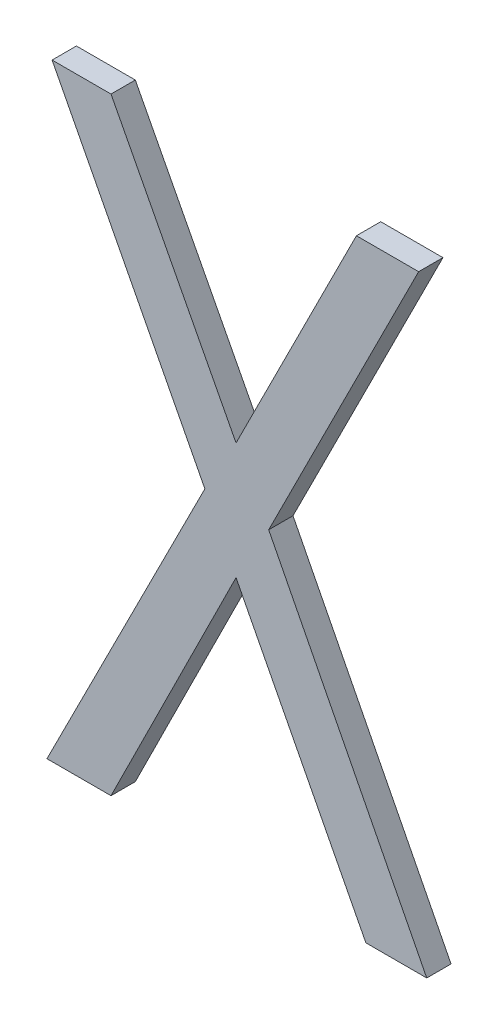
ISO-10303-21;
HEADER;
FILE_DESCRIPTION(('STEP AP214'),'2;1');
FILE_NAME('part.step','',(''),(''),'','','');
FILE_SCHEMA(('AUTOMOTIVE_DESIGN { 1 0 10303 214 1 1 1 1 }'));
ENDSEC;
DATA;
#1=APPLICATION_CONTEXT('core data for automotive mechanical design processes');
#2=APPLICATION_PROTOCOL_DEFINITION('international standard','automotive_design',2000,#1);
#3=PRODUCT_CONTEXT('',#1,'mechanical');
#4=PRODUCT('Part','Part','',(#3));
#5=PRODUCT_RELATED_PRODUCT_CATEGORY('part','',(#4));
#6=PRODUCT_DEFINITION_FORMATION('','',#4);
#7=PRODUCT_DEFINITION_CONTEXT('part definition',#1,'design');
#8=PRODUCT_DEFINITION('design','',#6,#7);
#9=PRODUCT_DEFINITION_SHAPE('','',#8);
#10=(LENGTH_UNIT() NAMED_UNIT(*) SI_UNIT(.MILLI.,.METRE.));
#11=(NAMED_UNIT(*) PLANE_ANGLE_UNIT() SI_UNIT($,.RADIAN.));
#12=(NAMED_UNIT(*) SI_UNIT($,.STERADIAN.) SOLID_ANGLE_UNIT());
#13=UNCERTAINTY_MEASURE_WITH_UNIT(LENGTH_MEASURE(1.E-05),#10,'distance_accuracy_value','');
#14=(GEOMETRIC_REPRESENTATION_CONTEXT(3) GLOBAL_UNCERTAINTY_ASSIGNED_CONTEXT((#13)) GLOBAL_UNIT_ASSIGNED_CONTEXT((#10,
#11,#12)) REPRESENTATION_CONTEXT('',''));
#15=CARTESIAN_POINT('',(0.,0.,0.));
#16=DIRECTION('',(0.,0.,1.));
#17=DIRECTION('',(1.,0.,0.));
#18=AXIS2_PLACEMENT_3D('',#15,#16,#17);
#19=CARTESIAN_POINT('',(160.482663651495,124.913993413852,-39.1));
#20=DIRECTION('',(0.,0.,-1.));
#21=DIRECTION('',(-1.,0.,0.));
#22=AXIS2_PLACEMENT_3D('',#19,#20,#21);
#23=PLANE('',#22);
#24=DIRECTION('',(0.448875504716677,0.893594304628979,0.));
#25=VECTOR('',#24,1.);
#26=CARTESIAN_POINT('',(159.957610010198,126.18583036462,-39.1));
#27=LINE('',#26,#25);
#28=CARTESIAN_POINT('',(159.957610010198,126.18583036462,-39.1));
#29=VERTEX_POINT('',#28);
#30=CARTESIAN_POINT('',(160.574548038722,127.413993413853,-39.1));
#31=VERTEX_POINT('',#30);
#32=EDGE_CURVE('E155',#29,#31,#27,.T.);
#33=ORIENTED_EDGE('',*,*,#32,.F.);
#34=DIRECTION('',(-0.455226922587405,0.890375453924692,0.));
#35=VECTOR('',#34,1.);
#36=CARTESIAN_POINT('',(160.607868750574,124.913993413852,-39.1));
#37=LINE('',#36,#35);
#38=CARTESIAN_POINT('',(160.607868750574,124.913993413852,-39.1));
#39=VERTEX_POINT('',#38);
#40=EDGE_CURVE('E159',#39,#29,#37,.T.);
#41=ORIENTED_EDGE('',*,*,#40,.F.);
#42=DIRECTION('',(-1.,0.,0.));
#43=VECTOR('',#42,1.);
#44=CARTESIAN_POINT('',(160.482663651495,124.913993413852,-39.1));
#45=LINE('',#44,#43);
#46=CARTESIAN_POINT('',(160.357458552417,124.913993413852,-39.1));
#47=VERTEX_POINT('',#46);
#48=EDGE_CURVE('E20',#39,#47,#45,.T.);
#49=ORIENTED_EDGE('',*,*,#48,.T.);
#50=DIRECTION('',(0.458860330473977,-0.888508411393675,0.));
#51=VECTOR('',#50,1.);
#52=CARTESIAN_POINT('',(159.823317444251,125.9482708093,-39.1));
#53=LINE('',#52,#51);
#54=CARTESIAN_POINT('',(159.823317444251,125.9482708093,-39.1));
#55=VERTEX_POINT('',#54);
#56=EDGE_CURVE('E116',#55,#47,#53,.T.);
#57=ORIENTED_EDGE('',*,*,#56,.F.);
#58=DIRECTION('',(0.445351686650897,0.895355725506461,0.));
#59=VECTOR('',#58,1.);
#60=CARTESIAN_POINT('',(159.308865847633,124.913993413852,-39.1));
#61=LINE('',#60,#59);
#62=CARTESIAN_POINT('',(159.308865847633,124.913993413852,-39.1));
#63=VERTEX_POINT('',#62);
#64=EDGE_CURVE('E107',#63,#55,#61,.T.);
#65=ORIENTED_EDGE('',*,*,#64,.F.);
#66=DIRECTION('',(1.,0.,0.));
#67=VECTOR('',#66,1.);
#68=CARTESIAN_POINT('',(159.045329308444,124.913993413852,-39.1));
#69=LINE('',#68,#67);
#70=CARTESIAN_POINT('',(159.045329308444,124.913993413852,-39.1));
#71=VERTEX_POINT('',#70);
#72=EDGE_CURVE('E102',#71,#63,#69,.T.);
#73=ORIENTED_EDGE('',*,*,#72,.F.);
#74=DIRECTION('',(-0.450849374392849,-0.892600045714528,0.));
#75=VECTOR('',#74,1.);
#76=CARTESIAN_POINT('',(159.695083189549,126.200388331799,-39.1));
#77=LINE('',#76,#75);
#78=CARTESIAN_POINT('',(159.695083189549,126.200388331798,-39.1));
#79=VERTEX_POINT('',#78);
#80=EDGE_CURVE('E131',#79,#71,#77,.T.);
#81=ORIENTED_EDGE('',*,*,#80,.F.);
#82=DIRECTION('',(0.459897940742603,-0.88797178113987,0.));
#83=VECTOR('',#82,1.);
#84=CARTESIAN_POINT('',(159.066533397804,127.413993413853,-39.1));
#85=LINE('',#84,#83);
#86=CARTESIAN_POINT('',(159.066533397804,127.413993413853,-39.1));
#87=VERTEX_POINT('',#86);
#88=EDGE_CURVE('E135',#87,#79,#85,.T.);
#89=ORIENTED_EDGE('',*,*,#88,.F.);
#90=DIRECTION('',(1.,0.,0.));
#91=VECTOR('',#90,1.);
#92=CARTESIAN_POINT('',(159.308865847633,127.413993413853,-39.1));
#93=LINE('',#92,#91);
#94=CARTESIAN_POINT('',(159.308865847633,127.413993413853,-39.1));
#95=VERTEX_POINT('',#94);
#96=EDGE_CURVE('E139',#95,#87,#93,.F.);
#97=ORIENTED_EDGE('',*,*,#96,.F.);
#98=DIRECTION('',(-0.462588432121608,0.886573145582062,0.));
#99=VECTOR('',#98,1.);
#100=CARTESIAN_POINT('',(159.823317444251,126.428022000406,-39.1));
#101=LINE('',#100,#99);
#102=CARTESIAN_POINT('',(159.823317444251,126.428022000406,-39.1));
#103=VERTEX_POINT('',#102);
#104=EDGE_CURVE('E143',#103,#95,#101,.T.);
#105=ORIENTED_EDGE('',*,*,#104,.F.);
#106=DIRECTION('',(-0.448866842978253,-0.893598655591388,0.));
#107=VECTOR('',#106,1.);
#108=CARTESIAN_POINT('',(160.31858438859,127.413993413853,-39.1));
#109=LINE('',#108,#107);
#110=CARTESIAN_POINT('',(160.31858438859,127.413993413853,-39.1));
#111=VERTEX_POINT('',#110);
#112=EDGE_CURVE('E147',#111,#103,#109,.T.);
#113=ORIENTED_EDGE('',*,*,#112,.F.);
#114=DIRECTION('',(1.,0.,0.));
#115=VECTOR('',#114,1.);
#116=CARTESIAN_POINT('',(160.574548038722,127.413993413853,-39.1));
#117=LINE('',#116,#115);
#118=EDGE_CURVE('E151',#31,#111,#117,.F.);
#119=ORIENTED_EDGE('',*,*,#118,.F.);
#120=EDGE_LOOP('',(#33,#41,#49,#57,#65,#73,#81,#89,#97,#105,#113,#119));
#121=FACE_BOUND('',#120,.T.);
#122=ADVANCED_FACE('F17',(#121),#23,.T.);
#123=CARTESIAN_POINT('',(159.823317444251,125.9482708093,-39.1));
#124=DIRECTION('',(-0.888508411393675,-0.458860330473977,0.));
#125=DIRECTION('',(0.458860330473977,-0.888508411393675,0.));
#126=AXIS2_PLACEMENT_3D('',#123,#124,#125);
#127=PLANE('',#126);
#128=ORIENTED_EDGE('',*,*,#56,.T.);
#129=DIRECTION('',(0.,0.,-1.));
#130=VECTOR('',#129,1.);
#131=CARTESIAN_POINT('',(160.357458552417,124.913993413852,-39.1));
#132=LINE('',#131,#130);
#133=CARTESIAN_POINT('',(160.357458552417,124.913993413852,-39.));
#134=VERTEX_POINT('',#133);
#135=EDGE_CURVE('E163',#134,#47,#132,.T.);
#136=ORIENTED_EDGE('',*,*,#135,.F.);
#137=DIRECTION('',(-0.458860330473984,0.888508411393672,0.));
#138=VECTOR('',#137,1.);
#139=CARTESIAN_POINT('',(160.357458552417,124.913993413852,-39.));
#140=LINE('',#139,#138);
#141=CARTESIAN_POINT('',(159.823317444251,125.9482708093,-39.));
#142=VERTEX_POINT('',#141);
#143=EDGE_CURVE('E126',#134,#142,#140,.T.);
#144=ORIENTED_EDGE('',*,*,#143,.T.);
#145=DIRECTION('',(0.,0.,1.));
#146=VECTOR('',#145,1.);
#147=CARTESIAN_POINT('',(159.823317444251,125.9482708093,-39.1));
#148=LINE('',#147,#146);
#149=EDGE_CURVE('E112',#55,#142,#148,.T.);
#150=ORIENTED_EDGE('',*,*,#149,.F.);
#151=EDGE_LOOP('',(#128,#136,#144,#150));
#152=FACE_BOUND('',#151,.T.);
#153=ADVANCED_FACE('F125',(#152),#127,.T.);
#154=CARTESIAN_POINT('',(159.308865847633,124.913993413852,-39.1));
#155=DIRECTION('',(0.895355725506461,-0.445351686650897,0.));
#156=DIRECTION('',(0.445351686650897,0.895355725506461,0.));
#157=AXIS2_PLACEMENT_3D('',#154,#155,#156);
#158=PLANE('',#157);
#159=ORIENTED_EDGE('',*,*,#64,.T.);
#160=ORIENTED_EDGE('',*,*,#149,.T.);
#161=DIRECTION('',(-0.445351686650952,-0.895355725506434,0.));
#162=VECTOR('',#161,1.);
#163=CARTESIAN_POINT('',(159.823317444251,125.9482708093,-39.));
#164=LINE('',#163,#162);
#165=CARTESIAN_POINT('',(159.308865847633,124.913993413852,-39.));
#166=VERTEX_POINT('',#165);
#167=EDGE_CURVE('E167',#142,#166,#164,.T.);
#168=ORIENTED_EDGE('',*,*,#167,.T.);
#169=DIRECTION('',(0.,0.,-1.));
#170=VECTOR('',#169,1.);
#171=CARTESIAN_POINT('',(159.308865847633,124.913993413852,-39.1));
#172=LINE('',#171,#170);
#173=EDGE_CURVE('E114',#63,#166,#172,.F.);
#174=ORIENTED_EDGE('',*,*,#173,.F.);
#175=EDGE_LOOP('',(#159,#160,#168,#174));
#176=FACE_BOUND('',#175,.T.);
#177=ADVANCED_FACE('F109',(#176),#158,.T.);
#178=CARTESIAN_POINT('',(159.045329308444,124.913993413852,-39.1));
#179=DIRECTION('',(0.,-1.,0.));
#180=DIRECTION('',(0.,0.,-1.));
#181=AXIS2_PLACEMENT_3D('',#178,#179,#180);
#182=PLANE('',#181);
#183=ORIENTED_EDGE('',*,*,#72,.T.);
#184=ORIENTED_EDGE('',*,*,#173,.T.);
#185=DIRECTION('',(-1.,0.,0.));
#186=VECTOR('',#185,1.);
#187=CARTESIAN_POINT('',(160.482663651495,124.913993413852,-39.));
#188=LINE('',#187,#186);
#189=CARTESIAN_POINT('',(159.045329308444,124.913993413852,-39.));
#190=VERTEX_POINT('',#189);
#191=EDGE_CURVE('E169',#166,#190,#188,.T.);
#192=ORIENTED_EDGE('',*,*,#191,.T.);
#193=DIRECTION('',(0.,0.,1.));
#194=VECTOR('',#193,1.);
#195=CARTESIAN_POINT('',(159.045329308444,124.913993413852,-39.1));
#196=LINE('',#195,#194);
#197=EDGE_CURVE('E133',#71,#190,#196,.T.);
#198=ORIENTED_EDGE('',*,*,#197,.F.);
#199=EDGE_LOOP('',(#183,#184,#192,#198));
#200=FACE_BOUND('',#199,.T.);
#201=ADVANCED_FACE('F234',(#200),#182,.T.);
#202=CARTESIAN_POINT('',(159.695083189549,126.200388331799,-39.1));
#203=DIRECTION('',(-0.892600045714528,0.450849374392849,0.));
#204=DIRECTION('',(-0.450849374392849,-0.892600045714528,0.));
#205=AXIS2_PLACEMENT_3D('',#202,#203,#204);
#206=PLANE('',#205);
#207=ORIENTED_EDGE('',*,*,#80,.T.);
#208=ORIENTED_EDGE('',*,*,#197,.T.);
#209=DIRECTION('',(0.45084937439287,0.892600045714517,0.));
#210=VECTOR('',#209,1.);
#211=CARTESIAN_POINT('',(159.045329308444,124.913993413852,-39.));
#212=LINE('',#211,#210);
#213=CARTESIAN_POINT('',(159.695083189549,126.200388331798,-39.));
#214=VERTEX_POINT('',#213);
#215=EDGE_CURVE('E172',#190,#214,#212,.T.);
#216=ORIENTED_EDGE('',*,*,#215,.T.);
#217=DIRECTION('',(0.,0.,1.));
#218=VECTOR('',#217,1.);
#219=CARTESIAN_POINT('',(159.695083189549,126.200388331798,-39.1));
#220=LINE('',#219,#218);
#221=EDGE_CURVE('E137',#79,#214,#220,.T.);
#222=ORIENTED_EDGE('',*,*,#221,.F.);
#223=EDGE_LOOP('',(#207,#208,#216,#222));
#224=FACE_BOUND('',#223,.T.);
#225=ADVANCED_FACE('F233',(#224),#206,.T.);
#226=CARTESIAN_POINT('',(159.066533397804,127.413993413853,-39.1));
#227=DIRECTION('',(-0.88797178113987,-0.459897940742603,0.));
#228=DIRECTION('',(0.459897940742603,-0.88797178113987,0.));
#229=AXIS2_PLACEMENT_3D('',#226,#227,#228);
#230=PLANE('',#229);
#231=ORIENTED_EDGE('',*,*,#88,.T.);
#232=ORIENTED_EDGE('',*,*,#221,.T.);
#233=DIRECTION('',(-0.459897940742623,0.887971781139859,0.));
#234=VECTOR('',#233,1.);
#235=CARTESIAN_POINT('',(159.695083189549,126.200388331799,-39.));
#236=LINE('',#235,#234);
#237=CARTESIAN_POINT('',(159.066533397804,127.413993413853,-39.));
#238=VERTEX_POINT('',#237);
#239=EDGE_CURVE('E175',#214,#238,#236,.T.);
#240=ORIENTED_EDGE('',*,*,#239,.T.);
#241=DIRECTION('',(0.,0.,1.));
#242=VECTOR('',#241,1.);
#243=CARTESIAN_POINT('',(159.066533397804,127.413993413853,-39.1));
#244=LINE('',#243,#242);
#245=EDGE_CURVE('E141',#87,#238,#244,.T.);
#246=ORIENTED_EDGE('',*,*,#245,.F.);
#247=EDGE_LOOP('',(#231,#232,#240,#246));
#248=FACE_BOUND('',#247,.T.);
#249=ADVANCED_FACE('F227',(#248),#230,.T.);
#250=CARTESIAN_POINT('',(159.308865847633,127.413993413853,-39.1));
#251=DIRECTION('',(0.,1.,0.));
#252=DIRECTION('',(0.,0.,1.));
#253=AXIS2_PLACEMENT_3D('',#250,#251,#252);
#254=PLANE('',#253);
#255=ORIENTED_EDGE('',*,*,#96,.T.);
#256=ORIENTED_EDGE('',*,*,#245,.T.);
#257=DIRECTION('',(-1.,0.,0.));
#258=VECTOR('',#257,1.);
#259=CARTESIAN_POINT('',(160.482663651495,127.413993413853,-39.));
#260=LINE('',#259,#258);
#261=CARTESIAN_POINT('',(159.308865847633,127.413993413853,-39.));
#262=VERTEX_POINT('',#261);
#263=EDGE_CURVE('E178',#238,#262,#260,.F.);
#264=ORIENTED_EDGE('',*,*,#263,.T.);
#265=DIRECTION('',(0.,0.,1.));
#266=VECTOR('',#265,1.);
#267=CARTESIAN_POINT('',(159.308865847633,127.413993413853,-39.1));
#268=LINE('',#267,#266);
#269=EDGE_CURVE('E145',#95,#262,#268,.T.);
#270=ORIENTED_EDGE('',*,*,#269,.F.);
#271=EDGE_LOOP('',(#255,#256,#264,#270));
#272=FACE_BOUND('',#271,.T.);
#273=ADVANCED_FACE('F223',(#272),#254,.T.);
#274=CARTESIAN_POINT('',(159.823317444251,126.428022000406,-39.1));
#275=DIRECTION('',(0.886573145582062,0.462588432121608,0.));
#276=DIRECTION('',(-0.462588432121608,0.886573145582062,0.));
#277=AXIS2_PLACEMENT_3D('',#274,#275,#276);
#278=PLANE('',#277);
#279=ORIENTED_EDGE('',*,*,#104,.T.);
#280=ORIENTED_EDGE('',*,*,#269,.T.);
#281=DIRECTION('',(0.462588432121642,-0.886573145582045,0.));
#282=VECTOR('',#281,1.);
#283=CARTESIAN_POINT('',(159.308865847633,127.413993413853,-39.));
#284=LINE('',#283,#282);
#285=CARTESIAN_POINT('',(159.823317444251,126.428022000406,-39.));
#286=VERTEX_POINT('',#285);
#287=EDGE_CURVE('E181',#262,#286,#284,.T.);
#288=ORIENTED_EDGE('',*,*,#287,.T.);
#289=DIRECTION('',(0.,0.,1.));
#290=VECTOR('',#289,1.);
#291=CARTESIAN_POINT('',(159.823317444251,126.428022000406,-39.1));
#292=LINE('',#291,#290);
#293=EDGE_CURVE('E149',#103,#286,#292,.T.);
#294=ORIENTED_EDGE('',*,*,#293,.F.);
#295=EDGE_LOOP('',(#279,#280,#288,#294));
#296=FACE_BOUND('',#295,.T.);
#297=ADVANCED_FACE('F217',(#296),#278,.T.);
#298=CARTESIAN_POINT('',(160.31858438859,127.413993413853,-39.1));
#299=DIRECTION('',(-0.893598655591388,0.448866842978253,0.));
#300=DIRECTION('',(-0.448866842978253,-0.893598655591388,0.));
#301=AXIS2_PLACEMENT_3D('',#298,#299,#300);
#302=PLANE('',#301);
#303=ORIENTED_EDGE('',*,*,#112,.T.);
#304=ORIENTED_EDGE('',*,*,#293,.T.);
#305=DIRECTION('',(0.448866842978172,0.893598655591429,0.));
#306=VECTOR('',#305,1.);
#307=CARTESIAN_POINT('',(159.823317444251,126.428022000406,-39.));
#308=LINE('',#307,#306);
#309=CARTESIAN_POINT('',(160.31858438859,127.413993413853,-39.));
#310=VERTEX_POINT('',#309);
#311=EDGE_CURVE('E184',#286,#310,#308,.T.);
#312=ORIENTED_EDGE('',*,*,#311,.T.);
#313=DIRECTION('',(0.,0.,1.));
#314=VECTOR('',#313,1.);
#315=CARTESIAN_POINT('',(160.31858438859,127.413993413853,-39.1));
#316=LINE('',#315,#314);
#317=EDGE_CURVE('E153',#111,#310,#316,.T.);
#318=ORIENTED_EDGE('',*,*,#317,.F.);
#319=EDGE_LOOP('',(#303,#304,#312,#318));
#320=FACE_BOUND('',#319,.T.);
#321=ADVANCED_FACE('F213',(#320),#302,.T.);
#322=CARTESIAN_POINT('',(160.574548038722,127.413993413853,-39.1));
#323=DIRECTION('',(0.,1.,0.));
#324=DIRECTION('',(0.,0.,1.));
#325=AXIS2_PLACEMENT_3D('',#322,#323,#324);
#326=PLANE('',#325);
#327=ORIENTED_EDGE('',*,*,#118,.T.);
#328=ORIENTED_EDGE('',*,*,#317,.T.);
#329=DIRECTION('',(-1.,0.,0.));
#330=VECTOR('',#329,1.);
#331=CARTESIAN_POINT('',(160.482663651495,127.413993413853,-39.));
#332=LINE('',#331,#330);
#333=CARTESIAN_POINT('',(160.574548038722,127.413993413853,-39.));
#334=VERTEX_POINT('',#333);
#335=EDGE_CURVE('E187',#310,#334,#332,.F.);
#336=ORIENTED_EDGE('',*,*,#335,.T.);
#337=DIRECTION('',(0.,0.,1.));
#338=VECTOR('',#337,1.);
#339=CARTESIAN_POINT('',(160.574548038722,127.413993413853,-39.1));
#340=LINE('',#339,#338);
#341=EDGE_CURVE('E157',#31,#334,#340,.T.);
#342=ORIENTED_EDGE('',*,*,#341,.F.);
#343=EDGE_LOOP('',(#327,#328,#336,#342));
#344=FACE_BOUND('',#343,.T.);
#345=ADVANCED_FACE('F207',(#344),#326,.T.);
#346=CARTESIAN_POINT('',(159.957610010198,126.18583036462,-39.1));
#347=DIRECTION('',(0.893594304628979,-0.448875504716677,0.));
#348=DIRECTION('',(0.448875504716677,0.893594304628979,0.));
#349=AXIS2_PLACEMENT_3D('',#346,#347,#348);
#350=PLANE('',#349);
#351=ORIENTED_EDGE('',*,*,#32,.T.);
#352=ORIENTED_EDGE('',*,*,#341,.T.);
#353=DIRECTION('',(-0.448875504716713,-0.893594304628961,0.));
#354=VECTOR('',#353,1.);
#355=CARTESIAN_POINT('',(160.574548038722,127.413993413853,-39.));
#356=LINE('',#355,#354);
#357=CARTESIAN_POINT('',(159.957610010198,126.18583036462,-39.));
#358=VERTEX_POINT('',#357);
#359=EDGE_CURVE('E190',#334,#358,#356,.T.);
#360=ORIENTED_EDGE('',*,*,#359,.T.);
#361=DIRECTION('',(0.,0.,1.));
#362=VECTOR('',#361,1.);
#363=CARTESIAN_POINT('',(159.957610010198,126.18583036462,-39.1));
#364=LINE('',#363,#362);
#365=EDGE_CURVE('E161',#29,#358,#364,.T.);
#366=ORIENTED_EDGE('',*,*,#365,.F.);
#367=EDGE_LOOP('',(#351,#352,#360,#366));
#368=FACE_BOUND('',#367,.T.);
#369=ADVANCED_FACE('F203',(#368),#350,.T.);
#370=CARTESIAN_POINT('',(160.607868750574,124.913993413852,-39.1));
#371=DIRECTION('',(0.890375453924692,0.455226922587405,0.));
#372=DIRECTION('',(-0.455226922587405,0.890375453924692,0.));
#373=AXIS2_PLACEMENT_3D('',#370,#371,#372);
#374=PLANE('',#373);
#375=ORIENTED_EDGE('',*,*,#40,.T.);
#376=ORIENTED_EDGE('',*,*,#365,.T.);
#377=DIRECTION('',(0.455226922587396,-0.890375453924696,0.));
#378=VECTOR('',#377,1.);
#379=CARTESIAN_POINT('',(159.957610010198,126.18583036462,-39.));
#380=LINE('',#379,#378);
#381=CARTESIAN_POINT('',(160.607868750574,124.913993413852,-39.));
#382=VERTEX_POINT('',#381);
#383=EDGE_CURVE('E26',#358,#382,#380,.T.);
#384=ORIENTED_EDGE('',*,*,#383,.T.);
#385=DIRECTION('',(0.,0.,-1.));
#386=VECTOR('',#385,1.);
#387=CARTESIAN_POINT('',(160.607868750574,124.913993413852,-39.1));
#388=LINE('',#387,#386);
#389=EDGE_CURVE('E34',#39,#382,#388,.F.);
#390=ORIENTED_EDGE('',*,*,#389,.F.);
#391=EDGE_LOOP('',(#375,#376,#384,#390));
#392=FACE_BOUND('',#391,.T.);
#393=ADVANCED_FACE('F196',(#392),#374,.T.);
#394=CARTESIAN_POINT('',(160.357458552417,124.913993413852,-39.1));
#395=DIRECTION('',(0.,-1.,0.));
#396=DIRECTION('',(0.,0.,-1.));
#397=AXIS2_PLACEMENT_3D('',#394,#395,#396);
#398=PLANE('',#397);
#399=ORIENTED_EDGE('',*,*,#48,.F.);
#400=ORIENTED_EDGE('',*,*,#389,.T.);
#401=DIRECTION('',(-1.,0.,0.));
#402=VECTOR('',#401,1.);
#403=CARTESIAN_POINT('',(160.482663651495,124.913993413852,-39.));
#404=LINE('',#403,#402);
#405=EDGE_CURVE('E11',#382,#134,#404,.T.);
#406=ORIENTED_EDGE('',*,*,#405,.T.);
#407=ORIENTED_EDGE('',*,*,#135,.T.);
#408=EDGE_LOOP('',(#399,#400,#406,#407));
#409=FACE_BOUND('',#408,.T.);
#410=ADVANCED_FACE('F235',(#409),#398,.T.);
#411=CARTESIAN_POINT('',(160.482663651495,124.913993413852,-39.));
#412=DIRECTION('',(0.,0.,-1.));
#413=DIRECTION('',(-1.,0.,0.));
#414=AXIS2_PLACEMENT_3D('',#411,#412,#413);
#415=PLANE('',#414);
#416=ORIENTED_EDGE('',*,*,#383,.F.);
#417=ORIENTED_EDGE('',*,*,#359,.F.);
#418=ORIENTED_EDGE('',*,*,#335,.F.);
#419=ORIENTED_EDGE('',*,*,#311,.F.);
#420=ORIENTED_EDGE('',*,*,#287,.F.);
#421=ORIENTED_EDGE('',*,*,#263,.F.);
#422=ORIENTED_EDGE('',*,*,#239,.F.);
#423=ORIENTED_EDGE('',*,*,#215,.F.);
#424=ORIENTED_EDGE('',*,*,#191,.F.);
#425=ORIENTED_EDGE('',*,*,#167,.F.);
#426=ORIENTED_EDGE('',*,*,#143,.F.);
#427=ORIENTED_EDGE('',*,*,#405,.F.);
#428=EDGE_LOOP('',(#416,#417,#418,#419,#420,#421,#422,#423,#424,#425,#426,#427));
#429=FACE_BOUND('',#428,.T.);
#430=ADVANCED_FACE('F200',(#429),#415,.F.);
#431=CLOSED_SHELL('',(#122,#153,#177,#201,#225,#249,#273,#297,#321,#345,#369,#393,#410,#430));
#432=MANIFOLD_SOLID_BREP('B1',#431);
#433=ADVANCED_BREP_SHAPE_REPRESENTATION('',(#18,#432),#14);
#434=SHAPE_DEFINITION_REPRESENTATION(#9,#433);
ENDSEC;
END-ISO-10303-21;
